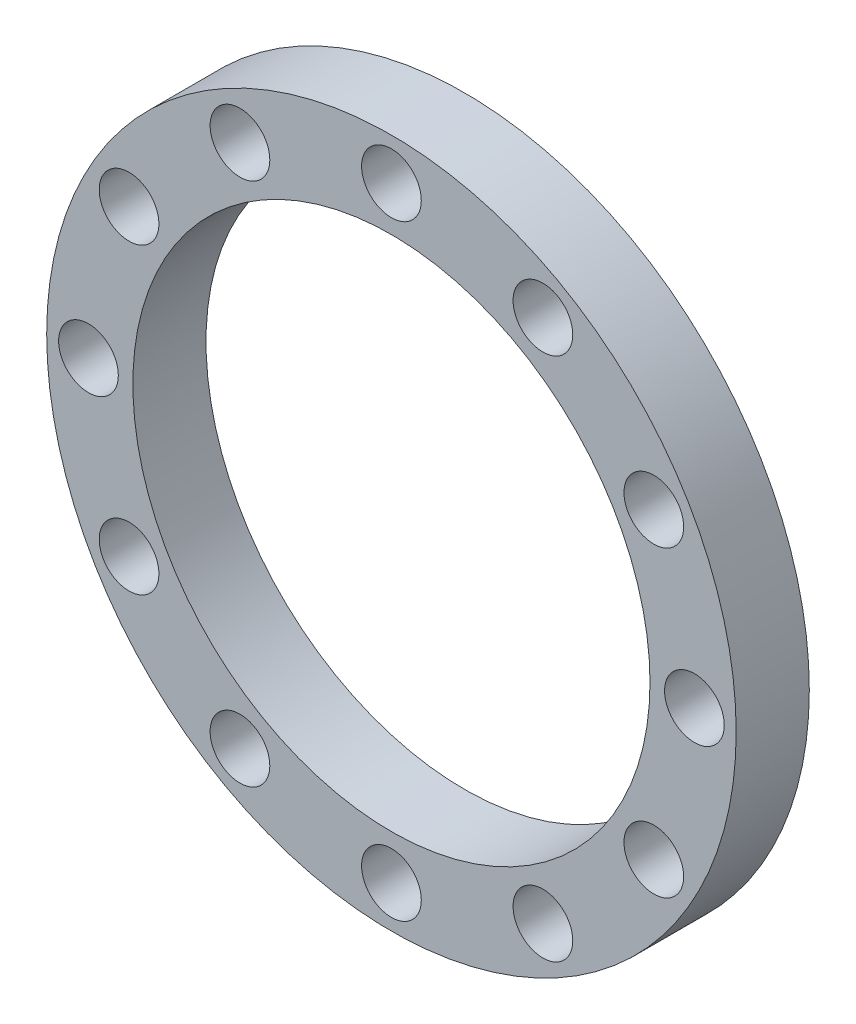
ISO-10303-21;
HEADER;
FILE_DESCRIPTION(('STEP AP214'),'2;1');
FILE_NAME('part.step','',(''),(''),'','','');
FILE_SCHEMA(('AUTOMOTIVE_DESIGN { 1 0 10303 214 1 1 1 1 }'));
ENDSEC;
DATA;
#1=APPLICATION_CONTEXT('core data for automotive mechanical design processes');
#2=APPLICATION_PROTOCOL_DEFINITION('international standard','automotive_design',2000,#1);
#3=PRODUCT_CONTEXT('',#1,'mechanical');
#4=PRODUCT('Part','Part','',(#3));
#5=PRODUCT_RELATED_PRODUCT_CATEGORY('part','',(#4));
#6=PRODUCT_DEFINITION_FORMATION('','',#4);
#7=PRODUCT_DEFINITION_CONTEXT('part definition',#1,'design');
#8=PRODUCT_DEFINITION('design','',#6,#7);
#9=PRODUCT_DEFINITION_SHAPE('','',#8);
#10=(LENGTH_UNIT() NAMED_UNIT(*) SI_UNIT(.MILLI.,.METRE.));
#11=(NAMED_UNIT(*) PLANE_ANGLE_UNIT() SI_UNIT($,.RADIAN.));
#12=(NAMED_UNIT(*) SI_UNIT($,.STERADIAN.) SOLID_ANGLE_UNIT());
#13=UNCERTAINTY_MEASURE_WITH_UNIT(LENGTH_MEASURE(1.E-05),#10,'distance_accuracy_value','');
#14=(GEOMETRIC_REPRESENTATION_CONTEXT(3) GLOBAL_UNCERTAINTY_ASSIGNED_CONTEXT((#13)) GLOBAL_UNIT_ASSIGNED_CONTEXT((#10,
#11,#12)) REPRESENTATION_CONTEXT('',''));
#15=CARTESIAN_POINT('',(0.,0.,0.));
#16=DIRECTION('',(0.,0.,1.));
#17=DIRECTION('',(1.,0.,0.));
#18=AXIS2_PLACEMENT_3D('',#15,#16,#17);
#19=CARTESIAN_POINT('',(0.,0.,70.));
#20=DIRECTION('',(0.,0.,1.));
#21=DIRECTION('',(1.,0.,0.));
#22=AXIS2_PLACEMENT_3D('',#19,#20,#21);
#23=PLANE('',#22);
#24=CARTESIAN_POINT('',(251.147367097493,145.000000000011,70.));
#25=DIRECTION('',(0.,0.,1.));
#26=DIRECTION('',(1.,0.,0.));
#27=AXIS2_PLACEMENT_3D('',#24,#25,#26);
#28=CIRCLE('',#27,28.5750000000034);
#29=CARTESIAN_POINT('',(279.722367097497,145.000000000011,70.));
#30=VERTEX_POINT('',#29);
#31=EDGE_CURVE('E64',#30,#30,#28,.F.);
#32=ORIENTED_EDGE('',*,*,#31,.T.);
#33=EDGE_LOOP('',(#32));
#34=FACE_BOUND('',#33,.T.);
#35=CARTESIAN_POINT('',(145.,251.147367097487,70.));
#36=DIRECTION('',(0.,0.,1.));
#37=DIRECTION('',(1.,0.,0.));
#38=AXIS2_PLACEMENT_3D('',#35,#36,#37);
#39=CIRCLE('',#38,28.575);
#40=CARTESIAN_POINT('',(173.575,251.147367097487,70.));
#41=VERTEX_POINT('',#40);
#42=EDGE_CURVE('E67',#41,#41,#39,.F.);
#43=ORIENTED_EDGE('',*,*,#42,.T.);
#44=EDGE_LOOP('',(#43));
#45=FACE_BOUND('',#44,.T.);
#46=CARTESIAN_POINT('',(0.,290.,70.));
#47=DIRECTION('',(0.,0.,1.));
#48=DIRECTION('',(1.,0.,0.));
#49=AXIS2_PLACEMENT_3D('',#46,#47,#48);
#50=CIRCLE('',#49,28.575);
#51=CARTESIAN_POINT('',(28.575,290.,70.));
#52=VERTEX_POINT('',#51);
#53=EDGE_CURVE('E70',#52,#52,#50,.F.);
#54=ORIENTED_EDGE('',*,*,#53,.T.);
#55=EDGE_LOOP('',(#54));
#56=FACE_BOUND('',#55,.T.);
#57=CARTESIAN_POINT('',(-144.999999999998,251.147367097481,70.));
#58=DIRECTION('',(0.,0.,1.));
#59=DIRECTION('',(1.,0.,0.));
#60=AXIS2_PLACEMENT_3D('',#57,#58,#59);
#61=CIRCLE('',#60,28.5750000000072);
#62=CARTESIAN_POINT('',(-116.424999999991,251.147367097481,70.));
#63=VERTEX_POINT('',#62);
#64=EDGE_CURVE('E73',#63,#63,#61,.F.);
#65=ORIENTED_EDGE('',*,*,#64,.T.);
#66=EDGE_LOOP('',(#65));
#67=FACE_BOUND('',#66,.T.);
#68=CARTESIAN_POINT('',(-251.147367097481,144.999999999989,70.));
#69=DIRECTION('',(0.,0.,1.));
#70=DIRECTION('',(1.,0.,0.));
#71=AXIS2_PLACEMENT_3D('',#68,#69,#70);
#72=CIRCLE('',#71,28.5750000000125);
#73=CARTESIAN_POINT('',(-222.572367097469,144.999999999989,70.));
#74=VERTEX_POINT('',#73);
#75=EDGE_CURVE('E76',#74,#74,#72,.F.);
#76=ORIENTED_EDGE('',*,*,#75,.T.);
#77=EDGE_LOOP('',(#76));
#78=FACE_BOUND('',#77,.T.);
#79=CARTESIAN_POINT('',(145.000000000023,-251.147367097481,70.));
#80=DIRECTION('',(0.,0.,1.));
#81=DIRECTION('',(1.,0.,0.));
#82=AXIS2_PLACEMENT_3D('',#79,#80,#81);
#83=CIRCLE('',#82,28.5750000000219);
#84=CARTESIAN_POINT('',(173.575000000045,-251.147367097481,70.));
#85=VERTEX_POINT('',#84);
#86=EDGE_CURVE('E79',#85,#85,#83,.F.);
#87=ORIENTED_EDGE('',*,*,#86,.T.);
#88=EDGE_LOOP('',(#87));
#89=FACE_BOUND('',#88,.T.);
#90=CARTESIAN_POINT('',(-144.999999999977,-251.147367097493,70.));
#91=DIRECTION('',(0.,0.,1.));
#92=DIRECTION('',(1.,0.,0.));
#93=AXIS2_PLACEMENT_3D('',#90,#91,#92);
#94=CIRCLE('',#93,28.5750000000261);
#95=CARTESIAN_POINT('',(-116.424999999951,-251.147367097493,70.));
#96=VERTEX_POINT('',#95);
#97=EDGE_CURVE('E82',#96,#96,#94,.F.);
#98=ORIENTED_EDGE('',*,*,#97,.T.);
#99=EDGE_LOOP('',(#98));
#100=FACE_BOUND('',#99,.T.);
#101=CARTESIAN_POINT('',(251.147367097506,-144.999999999989,70.));
#102=DIRECTION('',(0.,0.,1.));
#103=DIRECTION('',(1.,0.,0.));
#104=AXIS2_PLACEMENT_3D('',#101,#102,#103);
#105=CIRCLE('',#104,28.5750000000159);
#106=CARTESIAN_POINT('',(279.722367097522,-144.999999999989,70.));
#107=VERTEX_POINT('',#106);
#108=EDGE_CURVE('E85',#107,#107,#105,.F.);
#109=ORIENTED_EDGE('',*,*,#108,.T.);
#110=EDGE_LOOP('',(#109));
#111=FACE_BOUND('',#110,.T.);
#112=CARTESIAN_POINT('',(2.46558576901009E-11,-290.,70.));
#113=DIRECTION('',(0.,0.,1.));
#114=DIRECTION('',(1.,0.,0.));
#115=AXIS2_PLACEMENT_3D('',#112,#113,#114);
#116=CIRCLE('',#115,28.5750000000255);
#117=CARTESIAN_POINT('',(28.5750000000502,-290.,70.));
#118=VERTEX_POINT('',#117);
#119=EDGE_CURVE('E88',#118,#118,#116,.F.);
#120=ORIENTED_EDGE('',*,*,#119,.T.);
#121=EDGE_LOOP('',(#120));
#122=FACE_BOUND('',#121,.T.);
#123=CARTESIAN_POINT('',(-251.147367097469,-145.000000000011,70.));
#124=DIRECTION('',(0.,0.,1.));
#125=DIRECTION('',(1.,0.,0.));
#126=AXIS2_PLACEMENT_3D('',#123,#124,#125);
#127=CIRCLE('',#126,28.5750000000236);
#128=CARTESIAN_POINT('',(-222.572367097445,-145.000000000011,70.));
#129=VERTEX_POINT('',#128);
#130=EDGE_CURVE('E91',#129,#129,#127,.F.);
#131=ORIENTED_EDGE('',*,*,#130,.T.);
#132=EDGE_LOOP('',(#131));
#133=FACE_BOUND('',#132,.T.);
#134=CARTESIAN_POINT('',(-289.999999999988,-1.23634436022257E-11,70.));
#135=DIRECTION('',(0.,0.,1.));
#136=DIRECTION('',(1.,0.,0.));
#137=AXIS2_PLACEMENT_3D('',#134,#135,#136);
#138=CIRCLE('',#137,28.5750000000184);
#139=CARTESIAN_POINT('',(-261.424999999969,-1.23634436022257E-11,70.));
#140=VERTEX_POINT('',#139);
#141=EDGE_CURVE('E94',#140,#140,#138,.F.);
#142=ORIENTED_EDGE('',*,*,#141,.T.);
#143=EDGE_LOOP('',(#142));
#144=FACE_BOUND('',#143,.T.);
#145=CARTESIAN_POINT('',(290.000000000012,1.23279288450505E-11,70.));
#146=DIRECTION('',(0.,0.,1.));
#147=DIRECTION('',(1.,0.,0.));
#148=AXIS2_PLACEMENT_3D('',#145,#146,#147);
#149=CIRCLE('',#148,28.5750000000092);
#150=CARTESIAN_POINT('',(318.575000000021,1.23279288450505E-11,70.));
#151=VERTEX_POINT('',#150);
#152=EDGE_CURVE('E56',#151,#151,#149,.F.);
#153=ORIENTED_EDGE('',*,*,#152,.T.);
#154=EDGE_LOOP('',(#153));
#155=FACE_BOUND('',#154,.T.);
#156=CARTESIAN_POINT('',(0.,0.,70.));
#157=DIRECTION('',(0.,0.,1.));
#158=DIRECTION('',(1.,0.,0.));
#159=AXIS2_PLACEMENT_3D('',#156,#157,#158);
#160=CIRCLE('',#159,330.);
#161=CARTESIAN_POINT('',(330.,0.,70.));
#162=VERTEX_POINT('',#161);
#163=EDGE_CURVE('E11',#162,#162,#160,.T.);
#164=ORIENTED_EDGE('',*,*,#163,.T.);
#165=EDGE_LOOP('',(#164));
#166=FACE_BOUND('',#165,.T.);
#167=CARTESIAN_POINT('',(0.,0.,70.));
#168=DIRECTION('',(0.,0.,1.));
#169=DIRECTION('',(1.,0.,0.));
#170=AXIS2_PLACEMENT_3D('',#167,#168,#169);
#171=CIRCLE('',#170,247.5);
#172=CARTESIAN_POINT('',(247.5,0.,70.));
#173=VERTEX_POINT('',#172);
#174=EDGE_CURVE('E51',#173,#173,#171,.T.);
#175=ORIENTED_EDGE('',*,*,#174,.F.);
#176=EDGE_LOOP('',(#175));
#177=FACE_BOUND('',#176,.T.);
#178=ADVANCED_FACE('F40',(#34,#45,#56,#67,#78,#89,#100,#111,#122,#133,#144,#155,#166,#177),#23,.T.);
#179=CARTESIAN_POINT('',(0.,0.,0.));
#180=DIRECTION('',(0.,0.,1.));
#181=DIRECTION('',(1.,0.,0.));
#182=AXIS2_PLACEMENT_3D('',#179,#180,#181);
#183=PLANE('',#182);
#184=CARTESIAN_POINT('',(251.147367097493,145.000000000011,0.));
#185=DIRECTION('',(0.,0.,1.));
#186=DIRECTION('',(1.,0.,0.));
#187=AXIS2_PLACEMENT_3D('',#184,#185,#186);
#188=CIRCLE('',#187,28.5750000000034);
#189=CARTESIAN_POINT('',(279.722367097497,145.000000000011,0.));
#190=VERTEX_POINT('',#189);
#191=EDGE_CURVE('E97',#190,#190,#188,.T.);
#192=ORIENTED_EDGE('',*,*,#191,.T.);
#193=EDGE_LOOP('',(#192));
#194=FACE_BOUND('',#193,.T.);
#195=CARTESIAN_POINT('',(145.,251.147367097487,0.));
#196=DIRECTION('',(0.,0.,1.));
#197=DIRECTION('',(1.,0.,0.));
#198=AXIS2_PLACEMENT_3D('',#195,#196,#197);
#199=CIRCLE('',#198,28.575);
#200=CARTESIAN_POINT('',(173.575,251.147367097487,0.));
#201=VERTEX_POINT('',#200);
#202=EDGE_CURVE('E125',#201,#201,#199,.T.);
#203=ORIENTED_EDGE('',*,*,#202,.T.);
#204=EDGE_LOOP('',(#203));
#205=FACE_BOUND('',#204,.T.);
#206=CARTESIAN_POINT('',(0.,290.,0.));
#207=DIRECTION('',(0.,0.,1.));
#208=DIRECTION('',(1.,0.,0.));
#209=AXIS2_PLACEMENT_3D('',#206,#207,#208);
#210=CIRCLE('',#209,28.575);
#211=CARTESIAN_POINT('',(28.575,290.,0.));
#212=VERTEX_POINT('',#211);
#213=EDGE_CURVE('E122',#212,#212,#210,.T.);
#214=ORIENTED_EDGE('',*,*,#213,.T.);
#215=EDGE_LOOP('',(#214));
#216=FACE_BOUND('',#215,.T.);
#217=CARTESIAN_POINT('',(-144.999999999998,251.147367097481,0.));
#218=DIRECTION('',(0.,0.,1.));
#219=DIRECTION('',(1.,0.,0.));
#220=AXIS2_PLACEMENT_3D('',#217,#218,#219);
#221=CIRCLE('',#220,28.5750000000072);
#222=CARTESIAN_POINT('',(-116.424999999991,251.147367097481,0.));
#223=VERTEX_POINT('',#222);
#224=EDGE_CURVE('E119',#223,#223,#221,.T.);
#225=ORIENTED_EDGE('',*,*,#224,.T.);
#226=EDGE_LOOP('',(#225));
#227=FACE_BOUND('',#226,.T.);
#228=CARTESIAN_POINT('',(-251.147367097481,144.999999999989,0.));
#229=DIRECTION('',(0.,0.,1.));
#230=DIRECTION('',(1.,0.,0.));
#231=AXIS2_PLACEMENT_3D('',#228,#229,#230);
#232=CIRCLE('',#231,28.5750000000125);
#233=CARTESIAN_POINT('',(-222.572367097469,144.999999999989,0.));
#234=VERTEX_POINT('',#233);
#235=EDGE_CURVE('E108',#234,#234,#232,.T.);
#236=ORIENTED_EDGE('',*,*,#235,.T.);
#237=EDGE_LOOP('',(#236));
#238=FACE_BOUND('',#237,.T.);
#239=CARTESIAN_POINT('',(145.000000000023,-251.147367097481,0.));
#240=DIRECTION('',(0.,0.,1.));
#241=DIRECTION('',(1.,0.,0.));
#242=AXIS2_PLACEMENT_3D('',#239,#240,#241);
#243=CIRCLE('',#242,28.5750000000219);
#244=CARTESIAN_POINT('',(173.575000000045,-251.147367097481,0.));
#245=VERTEX_POINT('',#244);
#246=EDGE_CURVE('E109',#245,#245,#243,.T.);
#247=ORIENTED_EDGE('',*,*,#246,.T.);
#248=EDGE_LOOP('',(#247));
#249=FACE_BOUND('',#248,.T.);
#250=CARTESIAN_POINT('',(-144.999999999977,-251.147367097493,0.));
#251=DIRECTION('',(0.,0.,1.));
#252=DIRECTION('',(1.,0.,0.));
#253=AXIS2_PLACEMENT_3D('',#250,#251,#252);
#254=CIRCLE('',#253,28.5750000000261);
#255=CARTESIAN_POINT('',(-116.424999999951,-251.147367097493,0.));
#256=VERTEX_POINT('',#255);
#257=EDGE_CURVE('E112',#256,#256,#254,.T.);
#258=ORIENTED_EDGE('',*,*,#257,.T.);
#259=EDGE_LOOP('',(#258));
#260=FACE_BOUND('',#259,.T.);
#261=CARTESIAN_POINT('',(251.147367097506,-144.999999999989,0.));
#262=DIRECTION('',(0.,0.,1.));
#263=DIRECTION('',(1.,0.,0.));
#264=AXIS2_PLACEMENT_3D('',#261,#262,#263);
#265=CIRCLE('',#264,28.5750000000159);
#266=CARTESIAN_POINT('',(279.722367097522,-144.999999999989,0.));
#267=VERTEX_POINT('',#266);
#268=EDGE_CURVE('E102',#267,#267,#265,.T.);
#269=ORIENTED_EDGE('',*,*,#268,.T.);
#270=EDGE_LOOP('',(#269));
#271=FACE_BOUND('',#270,.T.);
#272=CARTESIAN_POINT('',(2.46558576901009E-11,-290.,0.));
#273=DIRECTION('',(0.,0.,1.));
#274=DIRECTION('',(1.,0.,0.));
#275=AXIS2_PLACEMENT_3D('',#272,#273,#274);
#276=CIRCLE('',#275,28.5750000000255);
#277=CARTESIAN_POINT('',(28.5750000000502,-290.,0.));
#278=VERTEX_POINT('',#277);
#279=EDGE_CURVE('E98',#278,#278,#276,.T.);
#280=ORIENTED_EDGE('',*,*,#279,.T.);
#281=EDGE_LOOP('',(#280));
#282=FACE_BOUND('',#281,.T.);
#283=CARTESIAN_POINT('',(-251.147367097469,-145.000000000011,0.));
#284=DIRECTION('',(0.,0.,1.));
#285=DIRECTION('',(1.,0.,0.));
#286=AXIS2_PLACEMENT_3D('',#283,#284,#285);
#287=CIRCLE('',#286,28.5750000000236);
#288=CARTESIAN_POINT('',(-222.572367097445,-145.000000000011,0.));
#289=VERTEX_POINT('',#288);
#290=EDGE_CURVE('E101',#289,#289,#287,.T.);
#291=ORIENTED_EDGE('',*,*,#290,.T.);
#292=EDGE_LOOP('',(#291));
#293=FACE_BOUND('',#292,.T.);
#294=CARTESIAN_POINT('',(-289.999999999988,-1.23634436022257E-11,0.));
#295=DIRECTION('',(0.,0.,1.));
#296=DIRECTION('',(1.,0.,0.));
#297=AXIS2_PLACEMENT_3D('',#294,#295,#296);
#298=CIRCLE('',#297,28.5750000000184);
#299=CARTESIAN_POINT('',(-261.424999999969,-1.23634436022257E-11,0.));
#300=VERTEX_POINT('',#299);
#301=EDGE_CURVE('E105',#300,#300,#298,.T.);
#302=ORIENTED_EDGE('',*,*,#301,.T.);
#303=EDGE_LOOP('',(#302));
#304=FACE_BOUND('',#303,.T.);
#305=CARTESIAN_POINT('',(290.000000000012,1.23279288450505E-11,0.));
#306=DIRECTION('',(0.,0.,1.));
#307=DIRECTION('',(1.,0.,0.));
#308=AXIS2_PLACEMENT_3D('',#305,#306,#307);
#309=CIRCLE('',#308,28.5750000000092);
#310=CARTESIAN_POINT('',(318.575000000021,1.23279288450505E-11,0.));
#311=VERTEX_POINT('',#310);
#312=EDGE_CURVE('E61',#311,#311,#309,.T.);
#313=ORIENTED_EDGE('',*,*,#312,.T.);
#314=EDGE_LOOP('',(#313));
#315=FACE_BOUND('',#314,.T.);
#316=CARTESIAN_POINT('',(0.,0.,0.));
#317=DIRECTION('',(0.,0.,1.));
#318=DIRECTION('',(1.,0.,0.));
#319=AXIS2_PLACEMENT_3D('',#316,#317,#318);
#320=CIRCLE('',#319,330.);
#321=CARTESIAN_POINT('',(330.,0.,0.));
#322=VERTEX_POINT('',#321);
#323=EDGE_CURVE('E44',#322,#322,#320,.T.);
#324=ORIENTED_EDGE('',*,*,#323,.F.);
#325=EDGE_LOOP('',(#324));
#326=FACE_BOUND('',#325,.T.);
#327=CARTESIAN_POINT('',(0.,0.,0.));
#328=DIRECTION('',(0.,0.,1.));
#329=DIRECTION('',(1.,0.,0.));
#330=AXIS2_PLACEMENT_3D('',#327,#328,#329);
#331=CIRCLE('',#330,247.5);
#332=CARTESIAN_POINT('',(247.5,0.,0.));
#333=VERTEX_POINT('',#332);
#334=EDGE_CURVE('E53',#333,#333,#331,.T.);
#335=ORIENTED_EDGE('',*,*,#334,.T.);
#336=EDGE_LOOP('',(#335));
#337=FACE_BOUND('',#336,.T.);
#338=ADVANCED_FACE('F131',(#194,#205,#216,#227,#238,#249,#260,#271,#282,#293,#304,#315,#326,
#337),#183,.F.);
#339=CARTESIAN_POINT('',(0.,0.,70.));
#340=DIRECTION('',(0.,0.,-1.));
#341=DIRECTION('',(-1.,0.,0.));
#342=AXIS2_PLACEMENT_3D('',#339,#340,#341);
#343=CYLINDRICAL_SURFACE('',#342,330.);
#344=ORIENTED_EDGE('',*,*,#163,.F.);
#345=EDGE_LOOP('',(#344));
#346=FACE_BOUND('',#345,.T.);
#347=ORIENTED_EDGE('',*,*,#323,.T.);
#348=EDGE_LOOP('',(#347));
#349=FACE_BOUND('',#348,.T.);
#350=ADVANCED_FACE('F42',(#346,#349),#343,.T.);
#351=CARTESIAN_POINT('',(0.,0.,70.));
#352=DIRECTION('',(0.,0.,-1.));
#353=DIRECTION('',(-1.,0.,0.));
#354=AXIS2_PLACEMENT_3D('',#351,#352,#353);
#355=CYLINDRICAL_SURFACE('',#354,247.5);
#356=ORIENTED_EDGE('',*,*,#174,.T.);
#357=EDGE_LOOP('',(#356));
#358=FACE_BOUND('',#357,.T.);
#359=ORIENTED_EDGE('',*,*,#334,.F.);
#360=EDGE_LOOP('',(#359));
#361=FACE_BOUND('',#360,.T.);
#362=ADVANCED_FACE('F154',(#358,#361),#355,.F.);
#363=CARTESIAN_POINT('',(290.000000000012,1.23279288450505E-11,131.));
#364=DIRECTION('',(0.,0.,-1.));
#365=DIRECTION('',(-1.,0.,0.));
#366=AXIS2_PLACEMENT_3D('',#363,#364,#365);
#367=CYLINDRICAL_SURFACE('',#366,28.5750000000092);
#368=ORIENTED_EDGE('',*,*,#152,.F.);
#369=EDGE_LOOP('',(#368));
#370=FACE_BOUND('',#369,.T.);
#371=ORIENTED_EDGE('',*,*,#312,.F.);
#372=EDGE_LOOP('',(#371));
#373=FACE_BOUND('',#372,.T.);
#374=ADVANCED_FACE('F157',(#370,#373),#367,.F.);
#375=CARTESIAN_POINT('',(-289.999999999988,-1.23634436022257E-11,131.));
#376=DIRECTION('',(0.,0.,-1.));
#377=DIRECTION('',(-1.,0.,0.));
#378=AXIS2_PLACEMENT_3D('',#375,#376,#377);
#379=CYLINDRICAL_SURFACE('',#378,28.5750000000184);
#380=ORIENTED_EDGE('',*,*,#141,.F.);
#381=EDGE_LOOP('',(#380));
#382=FACE_BOUND('',#381,.T.);
#383=ORIENTED_EDGE('',*,*,#301,.F.);
#384=EDGE_LOOP('',(#383));
#385=FACE_BOUND('',#384,.T.);
#386=ADVANCED_FACE('F161',(#382,#385),#379,.F.);
#387=CARTESIAN_POINT('',(-251.147367097469,-145.000000000011,131.));
#388=DIRECTION('',(0.,0.,-1.));
#389=DIRECTION('',(-1.,0.,0.));
#390=AXIS2_PLACEMENT_3D('',#387,#388,#389);
#391=CYLINDRICAL_SURFACE('',#390,28.5750000000236);
#392=ORIENTED_EDGE('',*,*,#130,.F.);
#393=EDGE_LOOP('',(#392));
#394=FACE_BOUND('',#393,.T.);
#395=ORIENTED_EDGE('',*,*,#290,.F.);
#396=EDGE_LOOP('',(#395));
#397=FACE_BOUND('',#396,.T.);
#398=ADVANCED_FACE('F167',(#394,#397),#391,.F.);
#399=CARTESIAN_POINT('',(2.46558576901009E-11,-290.,131.));
#400=DIRECTION('',(0.,0.,-1.));
#401=DIRECTION('',(-1.,0.,0.));
#402=AXIS2_PLACEMENT_3D('',#399,#400,#401);
#403=CYLINDRICAL_SURFACE('',#402,28.5750000000255);
#404=ORIENTED_EDGE('',*,*,#119,.F.);
#405=EDGE_LOOP('',(#404));
#406=FACE_BOUND('',#405,.T.);
#407=ORIENTED_EDGE('',*,*,#279,.F.);
#408=EDGE_LOOP('',(#407));
#409=FACE_BOUND('',#408,.T.);
#410=ADVANCED_FACE('F163',(#406,#409),#403,.F.);
#411=CARTESIAN_POINT('',(251.147367097506,-144.999999999989,131.));
#412=DIRECTION('',(0.,0.,-1.));
#413=DIRECTION('',(-1.,0.,0.));
#414=AXIS2_PLACEMENT_3D('',#411,#412,#413);
#415=CYLINDRICAL_SURFACE('',#414,28.5750000000159);
#416=ORIENTED_EDGE('',*,*,#108,.F.);
#417=EDGE_LOOP('',(#416));
#418=FACE_BOUND('',#417,.T.);
#419=ORIENTED_EDGE('',*,*,#268,.F.);
#420=EDGE_LOOP('',(#419));
#421=FACE_BOUND('',#420,.T.);
#422=ADVANCED_FACE('F166',(#418,#421),#415,.F.);
#423=CARTESIAN_POINT('',(-144.999999999977,-251.147367097493,131.));
#424=DIRECTION('',(0.,0.,-1.));
#425=DIRECTION('',(-1.,0.,0.));
#426=AXIS2_PLACEMENT_3D('',#423,#424,#425);
#427=CYLINDRICAL_SURFACE('',#426,28.5750000000261);
#428=ORIENTED_EDGE('',*,*,#97,.F.);
#429=EDGE_LOOP('',(#428));
#430=FACE_BOUND('',#429,.T.);
#431=ORIENTED_EDGE('',*,*,#257,.F.);
#432=EDGE_LOOP('',(#431));
#433=FACE_BOUND('',#432,.T.);
#434=ADVANCED_FACE('F179',(#430,#433),#427,.F.);
#435=CARTESIAN_POINT('',(145.000000000023,-251.147367097481,131.));
#436=DIRECTION('',(0.,0.,-1.));
#437=DIRECTION('',(-1.,0.,0.));
#438=AXIS2_PLACEMENT_3D('',#435,#436,#437);
#439=CYLINDRICAL_SURFACE('',#438,28.5750000000219);
#440=ORIENTED_EDGE('',*,*,#86,.F.);
#441=EDGE_LOOP('',(#440));
#442=FACE_BOUND('',#441,.T.);
#443=ORIENTED_EDGE('',*,*,#246,.F.);
#444=EDGE_LOOP('',(#443));
#445=FACE_BOUND('',#444,.T.);
#446=ADVANCED_FACE('F175',(#442,#445),#439,.F.);
#447=CARTESIAN_POINT('',(-251.147367097481,144.999999999989,131.));
#448=DIRECTION('',(0.,0.,-1.));
#449=DIRECTION('',(-1.,0.,0.));
#450=AXIS2_PLACEMENT_3D('',#447,#448,#449);
#451=CYLINDRICAL_SURFACE('',#450,28.5750000000125);
#452=ORIENTED_EDGE('',*,*,#75,.F.);
#453=EDGE_LOOP('',(#452));
#454=FACE_BOUND('',#453,.T.);
#455=ORIENTED_EDGE('',*,*,#235,.F.);
#456=EDGE_LOOP('',(#455));
#457=FACE_BOUND('',#456,.T.);
#458=ADVANCED_FACE('F178',(#454,#457),#451,.F.);
#459=CARTESIAN_POINT('',(-144.999999999998,251.147367097481,131.));
#460=DIRECTION('',(0.,0.,-1.));
#461=DIRECTION('',(-1.,0.,0.));
#462=AXIS2_PLACEMENT_3D('',#459,#460,#461);
#463=CYLINDRICAL_SURFACE('',#462,28.5750000000072);
#464=ORIENTED_EDGE('',*,*,#64,.F.);
#465=EDGE_LOOP('',(#464));
#466=FACE_BOUND('',#465,.T.);
#467=ORIENTED_EDGE('',*,*,#224,.F.);
#468=EDGE_LOOP('',(#467));
#469=FACE_BOUND('',#468,.T.);
#470=ADVANCED_FACE('F189',(#466,#469),#463,.F.);
#471=CARTESIAN_POINT('',(0.,290.,131.));
#472=DIRECTION('',(0.,0.,-1.));
#473=DIRECTION('',(-1.,0.,0.));
#474=AXIS2_PLACEMENT_3D('',#471,#472,#473);
#475=CYLINDRICAL_SURFACE('',#474,28.575);
#476=ORIENTED_EDGE('',*,*,#53,.F.);
#477=EDGE_LOOP('',(#476));
#478=FACE_BOUND('',#477,.T.);
#479=ORIENTED_EDGE('',*,*,#213,.F.);
#480=EDGE_LOOP('',(#479));
#481=FACE_BOUND('',#480,.T.);
#482=ADVANCED_FACE('F142',(#478,#481),#475,.F.);
#483=CARTESIAN_POINT('',(145.,251.147367097487,131.));
#484=DIRECTION('',(0.,0.,-1.));
#485=DIRECTION('',(-1.,0.,0.));
#486=AXIS2_PLACEMENT_3D('',#483,#484,#485);
#487=CYLINDRICAL_SURFACE('',#486,28.575);
#488=ORIENTED_EDGE('',*,*,#42,.F.);
#489=EDGE_LOOP('',(#488));
#490=FACE_BOUND('',#489,.T.);
#491=ORIENTED_EDGE('',*,*,#202,.F.);
#492=EDGE_LOOP('',(#491));
#493=FACE_BOUND('',#492,.T.);
#494=ADVANCED_FACE('F136',(#490,#493),#487,.F.);
#495=CARTESIAN_POINT('',(251.147367097493,145.000000000011,131.));
#496=DIRECTION('',(0.,0.,-1.));
#497=DIRECTION('',(-1.,0.,0.));
#498=AXIS2_PLACEMENT_3D('',#495,#496,#497);
#499=CYLINDRICAL_SURFACE('',#498,28.5750000000034);
#500=ORIENTED_EDGE('',*,*,#31,.F.);
#501=EDGE_LOOP('',(#500));
#502=FACE_BOUND('',#501,.T.);
#503=ORIENTED_EDGE('',*,*,#191,.F.);
#504=EDGE_LOOP('',(#503));
#505=FACE_BOUND('',#504,.T.);
#506=ADVANCED_FACE('F134',(#502,#505),#499,.F.);
#507=CLOSED_SHELL('',(#178,#338,#350,#362,#374,#386,#398,#410,#422,#434,#446,#458,#470,#482,
#494,#506));
#508=MANIFOLD_SOLID_BREP('B2',#507);
#509=ADVANCED_BREP_SHAPE_REPRESENTATION('',(#18,#508),#14);
#510=SHAPE_DEFINITION_REPRESENTATION(#9,#509);
ENDSEC;
END-ISO-10303-21;
